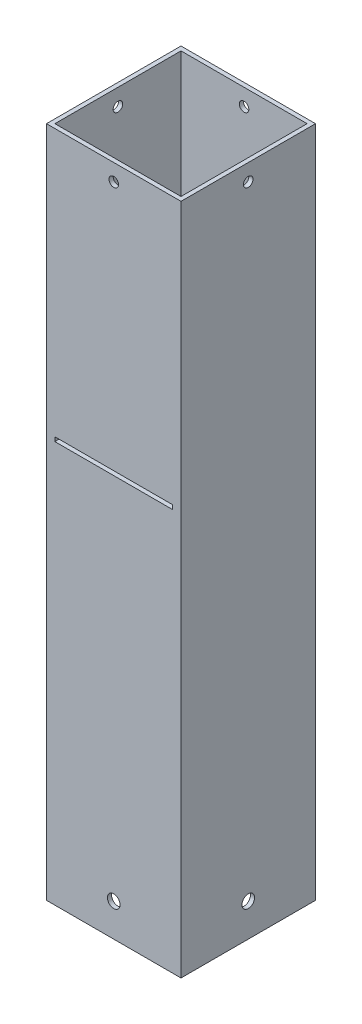
ISO-10303-21;
HEADER;
FILE_DESCRIPTION(('STEP AP214'),'2;1');
FILE_NAME('part.step','',(''),(''),'','','');
FILE_SCHEMA(('AUTOMOTIVE_DESIGN { 1 0 10303 214 1 1 1 1 }'));
ENDSEC;
DATA;
#1=APPLICATION_CONTEXT('core data for automotive mechanical design processes');
#2=APPLICATION_PROTOCOL_DEFINITION('international standard','automotive_design',2000,#1);
#3=PRODUCT_CONTEXT('',#1,'mechanical');
#4=PRODUCT('Part','Part','',(#3));
#5=PRODUCT_RELATED_PRODUCT_CATEGORY('part','',(#4));
#6=PRODUCT_DEFINITION_FORMATION('','',#4);
#7=PRODUCT_DEFINITION_CONTEXT('part definition',#1,'design');
#8=PRODUCT_DEFINITION('design','',#6,#7);
#9=PRODUCT_DEFINITION_SHAPE('','',#8);
#10=(LENGTH_UNIT() NAMED_UNIT(*) SI_UNIT(.MILLI.,.METRE.));
#11=(NAMED_UNIT(*) PLANE_ANGLE_UNIT() SI_UNIT($,.RADIAN.));
#12=(NAMED_UNIT(*) SI_UNIT($,.STERADIAN.) SOLID_ANGLE_UNIT());
#13=UNCERTAINTY_MEASURE_WITH_UNIT(LENGTH_MEASURE(1.E-05),#10,'distance_accuracy_value','');
#14=(GEOMETRIC_REPRESENTATION_CONTEXT(3) GLOBAL_UNCERTAINTY_ASSIGNED_CONTEXT((#13)) GLOBAL_UNIT_ASSIGNED_CONTEXT((#10,
#11,#12)) REPRESENTATION_CONTEXT('',''));
#15=CARTESIAN_POINT('',(0.,0.,0.));
#16=DIRECTION('',(0.,0.,1.));
#17=DIRECTION('',(1.,0.,0.));
#18=AXIS2_PLACEMENT_3D('',#15,#16,#17);
#19=CARTESIAN_POINT('',(0.,254.,0.));
#20=DIRECTION('',(0.,1.,0.));
#21=DIRECTION('',(0.,0.,1.));
#22=AXIS2_PLACEMENT_3D('',#19,#20,#21);
#23=PLANE('',#22);
#24=DIRECTION('',(0.,0.,1.));
#25=VECTOR('',#24,1.);
#26=CARTESIAN_POINT('',(-25.4,254.,-25.4));
#27=LINE('',#26,#25);
#28=CARTESIAN_POINT('',(-25.4,254.,-25.4));
#29=VERTEX_POINT('',#28);
#30=CARTESIAN_POINT('',(-25.4,254.,25.4));
#31=VERTEX_POINT('',#30);
#32=EDGE_CURVE('E278',#29,#31,#27,.T.);
#33=ORIENTED_EDGE('',*,*,#32,.T.);
#34=DIRECTION('',(1.,0.,0.));
#35=VECTOR('',#34,1.);
#36=CARTESIAN_POINT('',(-25.4,254.,25.4));
#37=LINE('',#36,#35);
#38=CARTESIAN_POINT('',(25.4,254.,25.4));
#39=VERTEX_POINT('',#38);
#40=EDGE_CURVE('E281',#31,#39,#37,.T.);
#41=ORIENTED_EDGE('',*,*,#40,.T.);
#42=DIRECTION('',(0.,0.,-1.));
#43=VECTOR('',#42,1.);
#44=CARTESIAN_POINT('',(25.4,254.,-25.4));
#45=LINE('',#44,#43);
#46=CARTESIAN_POINT('',(25.4,254.,-25.4));
#47=VERTEX_POINT('',#46);
#48=EDGE_CURVE('E284',#39,#47,#45,.T.);
#49=ORIENTED_EDGE('',*,*,#48,.T.);
#50=DIRECTION('',(-1.,0.,0.));
#51=VECTOR('',#50,1.);
#52=CARTESIAN_POINT('',(-25.4,254.,-25.4));
#53=LINE('',#52,#51);
#54=EDGE_CURVE('E286',#47,#29,#53,.T.);
#55=ORIENTED_EDGE('',*,*,#54,.T.);
#56=EDGE_LOOP('',(#33,#41,#49,#55));
#57=FACE_BOUND('',#56,.T.);
#58=DIRECTION('',(1.,0.,0.));
#59=VECTOR('',#58,1.);
#60=CARTESIAN_POINT('',(-23.8125,254.,23.8125));
#61=LINE('',#60,#59);
#62=CARTESIAN_POINT('',(-23.8125,254.,23.8125));
#63=VERTEX_POINT('',#62);
#64=CARTESIAN_POINT('',(23.8125,254.,23.8125));
#65=VERTEX_POINT('',#64);
#66=EDGE_CURVE('E249',#63,#65,#61,.T.);
#67=ORIENTED_EDGE('',*,*,#66,.F.);
#68=DIRECTION('',(0.,0.,1.));
#69=VECTOR('',#68,1.);
#70=CARTESIAN_POINT('',(-23.8125,254.,-23.8125));
#71=LINE('',#70,#69);
#72=CARTESIAN_POINT('',(-23.8125,254.,-23.8125));
#73=VERTEX_POINT('',#72);
#74=EDGE_CURVE('E247',#73,#63,#71,.T.);
#75=ORIENTED_EDGE('',*,*,#74,.F.);
#76=DIRECTION('',(-1.,0.,0.));
#77=VECTOR('',#76,1.);
#78=CARTESIAN_POINT('',(-23.8125,254.,-23.8125));
#79=LINE('',#78,#77);
#80=CARTESIAN_POINT('',(23.8125,254.,-23.8125));
#81=VERTEX_POINT('',#80);
#82=EDGE_CURVE('E255',#81,#73,#79,.T.);
#83=ORIENTED_EDGE('',*,*,#82,.F.);
#84=DIRECTION('',(0.,0.,-1.));
#85=VECTOR('',#84,1.);
#86=CARTESIAN_POINT('',(23.8125,254.,-23.8125));
#87=LINE('',#86,#85);
#88=EDGE_CURVE('E252',#65,#81,#87,.T.);
#89=ORIENTED_EDGE('',*,*,#88,.F.);
#90=EDGE_LOOP('',(#67,#75,#83,#89));
#91=FACE_BOUND('',#90,.T.);
#92=ADVANCED_FACE('F38',(#57,#91),#23,.T.);
#93=CARTESIAN_POINT('',(0.,0.,0.));
#94=DIRECTION('',(0.,1.,0.));
#95=DIRECTION('',(0.,0.,1.));
#96=AXIS2_PLACEMENT_3D('',#93,#94,#95);
#97=PLANE('',#96);
#98=DIRECTION('',(0.,0.,1.));
#99=VECTOR('',#98,1.);
#100=CARTESIAN_POINT('',(-25.4,0.,-25.4));
#101=LINE('',#100,#99);
#102=CARTESIAN_POINT('',(-25.4,0.,-25.4));
#103=VERTEX_POINT('',#102);
#104=CARTESIAN_POINT('',(-25.4,0.,25.4));
#105=VERTEX_POINT('',#104);
#106=EDGE_CURVE('E277',#103,#105,#101,.T.);
#107=ORIENTED_EDGE('',*,*,#106,.F.);
#108=DIRECTION('',(-1.,0.,0.));
#109=VECTOR('',#108,1.);
#110=CARTESIAN_POINT('',(-25.4,0.,-25.4));
#111=LINE('',#110,#109);
#112=CARTESIAN_POINT('',(25.4,0.,-25.4));
#113=VERTEX_POINT('',#112);
#114=EDGE_CURVE('E282',#113,#103,#111,.T.);
#115=ORIENTED_EDGE('',*,*,#114,.F.);
#116=DIRECTION('',(0.,0.,-1.));
#117=VECTOR('',#116,1.);
#118=CARTESIAN_POINT('',(25.4,0.,-25.4));
#119=LINE('',#118,#117);
#120=CARTESIAN_POINT('',(25.4,0.,25.4));
#121=VERTEX_POINT('',#120);
#122=EDGE_CURVE('E293',#121,#113,#119,.T.);
#123=ORIENTED_EDGE('',*,*,#122,.F.);
#124=DIRECTION('',(1.,0.,0.));
#125=VECTOR('',#124,1.);
#126=CARTESIAN_POINT('',(-25.4,0.,25.4));
#127=LINE('',#126,#125);
#128=EDGE_CURVE('E291',#105,#121,#127,.T.);
#129=ORIENTED_EDGE('',*,*,#128,.F.);
#130=EDGE_LOOP('',(#107,#115,#123,#129));
#131=FACE_BOUND('',#130,.T.);
#132=DIRECTION('',(0.,0.,1.));
#133=VECTOR('',#132,1.);
#134=CARTESIAN_POINT('',(-23.8125,0.,-23.8125));
#135=LINE('',#134,#133);
#136=CARTESIAN_POINT('',(-23.8125,0.,-23.8125));
#137=VERTEX_POINT('',#136);
#138=CARTESIAN_POINT('',(-23.8125,0.,23.8125));
#139=VERTEX_POINT('',#138);
#140=EDGE_CURVE('E246',#137,#139,#135,.T.);
#141=ORIENTED_EDGE('',*,*,#140,.T.);
#142=DIRECTION('',(1.,0.,0.));
#143=VECTOR('',#142,1.);
#144=CARTESIAN_POINT('',(-23.8125,0.,23.8125));
#145=LINE('',#144,#143);
#146=CARTESIAN_POINT('',(23.8125,0.,23.8125));
#147=VERTEX_POINT('',#146);
#148=EDGE_CURVE('E260',#139,#147,#145,.T.);
#149=ORIENTED_EDGE('',*,*,#148,.T.);
#150=DIRECTION('',(0.,0.,-1.));
#151=VECTOR('',#150,1.);
#152=CARTESIAN_POINT('',(23.8125,0.,-23.8125));
#153=LINE('',#152,#151);
#154=CARTESIAN_POINT('',(23.8125,0.,-23.8125));
#155=VERTEX_POINT('',#154);
#156=EDGE_CURVE('E263',#147,#155,#153,.T.);
#157=ORIENTED_EDGE('',*,*,#156,.T.);
#158=DIRECTION('',(-1.,0.,0.));
#159=VECTOR('',#158,1.);
#160=CARTESIAN_POINT('',(-23.8125,0.,-23.8125));
#161=LINE('',#160,#159);
#162=EDGE_CURVE('E250',#155,#137,#161,.T.);
#163=ORIENTED_EDGE('',*,*,#162,.T.);
#164=EDGE_LOOP('',(#141,#149,#157,#163));
#165=FACE_BOUND('',#164,.T.);
#166=ADVANCED_FACE('F341',(#131,#165),#97,.F.);
#167=CARTESIAN_POINT('',(-25.4,254.,-25.4));
#168=DIRECTION('',(1.,0.,0.));
#169=DIRECTION('',(0.,0.,-1.));
#170=AXIS2_PLACEMENT_3D('',#167,#168,#169);
#171=PLANE('',#170);
#172=CARTESIAN_POINT('',(-25.4,247.65,0.));
#173=DIRECTION('',(1.,0.,0.));
#174=DIRECTION('',(0.,0.,-1.));
#175=AXIS2_PLACEMENT_3D('',#172,#173,#174);
#176=CIRCLE('',#175,1.8034);
#177=CARTESIAN_POINT('',(-25.4,247.65,-1.80339999999998));
#178=VERTEX_POINT('',#177);
#179=EDGE_CURVE('E217',#178,#178,#176,.T.);
#180=ORIENTED_EDGE('',*,*,#179,.T.);
#181=EDGE_LOOP('',(#180));
#182=FACE_BOUND('',#181,.T.);
#183=CARTESIAN_POINT('',(-25.4,12.412400118,0.));
#184=DIRECTION('',(1.,0.,0.));
#185=DIRECTION('',(0.,0.,-1.));
#186=AXIS2_PLACEMENT_3D('',#183,#184,#185);
#187=CIRCLE('',#186,2.3999952);
#188=CARTESIAN_POINT('',(-25.4,12.412400118,-2.39999519999999));
#189=VERTEX_POINT('',#188);
#190=EDGE_CURVE('E236',#189,#189,#187,.T.);
#191=ORIENTED_EDGE('',*,*,#190,.T.);
#192=EDGE_LOOP('',(#191));
#193=FACE_BOUND('',#192,.T.);
#194=ORIENTED_EDGE('',*,*,#106,.T.);
#195=DIRECTION('',(0.,-1.,0.));
#196=VECTOR('',#195,1.);
#197=CARTESIAN_POINT('',(-25.4,254.,25.4));
#198=LINE('',#197,#196);
#199=EDGE_CURVE('E304',#31,#105,#198,.T.);
#200=ORIENTED_EDGE('',*,*,#199,.F.);
#201=ORIENTED_EDGE('',*,*,#32,.F.);
#202=DIRECTION('',(0.,-1.,0.));
#203=VECTOR('',#202,1.);
#204=CARTESIAN_POINT('',(-25.4,254.,-25.4));
#205=LINE('',#204,#203);
#206=EDGE_CURVE('E288',#29,#103,#205,.T.);
#207=ORIENTED_EDGE('',*,*,#206,.T.);
#208=EDGE_LOOP('',(#194,#200,#201,#207));
#209=FACE_BOUND('',#208,.T.);
#210=ADVANCED_FACE('F40',(#182,#193,#209),#171,.F.);
#211=CARTESIAN_POINT('',(-25.4,254.,25.4));
#212=DIRECTION('',(0.,0.,-1.));
#213=DIRECTION('',(-1.,0.,0.));
#214=AXIS2_PLACEMENT_3D('',#211,#212,#213);
#215=PLANE('',#214);
#216=DIRECTION('',(1.,0.,0.));
#217=VECTOR('',#216,1.);
#218=CARTESIAN_POINT('',(-22.225,151.60625,25.4));
#219=LINE('',#218,#217);
#220=CARTESIAN_POINT('',(-22.225,151.60625,25.4));
#221=VERTEX_POINT('',#220);
#222=CARTESIAN_POINT('',(22.225,151.60625,25.4));
#223=VERTEX_POINT('',#222);
#224=EDGE_CURVE('E184',#221,#223,#219,.T.);
#225=ORIENTED_EDGE('',*,*,#224,.F.);
#226=DIRECTION('',(0.,-1.,0.));
#227=VECTOR('',#226,1.);
#228=CARTESIAN_POINT('',(-22.225,153.19375,25.4));
#229=LINE('',#228,#227);
#230=CARTESIAN_POINT('',(-22.225,153.19375,25.4));
#231=VERTEX_POINT('',#230);
#232=EDGE_CURVE('E53',#231,#221,#229,.T.);
#233=ORIENTED_EDGE('',*,*,#232,.F.);
#234=DIRECTION('',(-1.,0.,0.));
#235=VECTOR('',#234,1.);
#236=CARTESIAN_POINT('',(-22.225,153.19375,25.4));
#237=LINE('',#236,#235);
#238=CARTESIAN_POINT('',(22.225,153.19375,25.4));
#239=VERTEX_POINT('',#238);
#240=EDGE_CURVE('E175',#239,#231,#237,.T.);
#241=ORIENTED_EDGE('',*,*,#240,.F.);
#242=DIRECTION('',(0.,1.,0.));
#243=VECTOR('',#242,1.);
#244=CARTESIAN_POINT('',(22.225,153.19375,25.4));
#245=LINE('',#244,#243);
#246=EDGE_CURVE('E178',#223,#239,#245,.T.);
#247=ORIENTED_EDGE('',*,*,#246,.F.);
#248=EDGE_LOOP('',(#225,#233,#241,#247));
#249=FACE_BOUND('',#248,.T.);
#250=CARTESIAN_POINT('',(0.,247.65,25.4));
#251=DIRECTION('',(0.,0.,1.));
#252=DIRECTION('',(1.,0.,0.));
#253=AXIS2_PLACEMENT_3D('',#250,#251,#252);
#254=CIRCLE('',#253,1.8034);
#255=CARTESIAN_POINT('',(1.8034,247.65,25.4));
#256=VERTEX_POINT('',#255);
#257=EDGE_CURVE('E206',#256,#256,#254,.T.);
#258=ORIENTED_EDGE('',*,*,#257,.F.);
#259=EDGE_LOOP('',(#258));
#260=FACE_BOUND('',#259,.T.);
#261=CARTESIAN_POINT('',(0.,12.412400118,25.4));
#262=DIRECTION('',(0.,0.,-1.));
#263=DIRECTION('',(-1.,0.,0.));
#264=AXIS2_PLACEMENT_3D('',#261,#262,#263);
#265=CIRCLE('',#264,2.3999952);
#266=CARTESIAN_POINT('',(-2.39999520000001,12.412400118,25.4));
#267=VERTEX_POINT('',#266);
#268=EDGE_CURVE('E227',#267,#267,#265,.T.);
#269=ORIENTED_EDGE('',*,*,#268,.T.);
#270=EDGE_LOOP('',(#269));
#271=FACE_BOUND('',#270,.T.);
#272=ORIENTED_EDGE('',*,*,#128,.T.);
#273=DIRECTION('',(0.,-1.,0.));
#274=VECTOR('',#273,1.);
#275=CARTESIAN_POINT('',(25.4,254.,25.4));
#276=LINE('',#275,#274);
#277=EDGE_CURVE('E301',#39,#121,#276,.T.);
#278=ORIENTED_EDGE('',*,*,#277,.F.);
#279=ORIENTED_EDGE('',*,*,#40,.F.);
#280=ORIENTED_EDGE('',*,*,#199,.T.);
#281=EDGE_LOOP('',(#272,#278,#279,#280));
#282=FACE_BOUND('',#281,.T.);
#283=ADVANCED_FACE('F358',(#249,#260,#271,#282),#215,.F.);
#284=CARTESIAN_POINT('',(25.4,254.,-25.4));
#285=DIRECTION('',(-1.,0.,0.));
#286=DIRECTION('',(0.,0.,1.));
#287=AXIS2_PLACEMENT_3D('',#284,#285,#286);
#288=PLANE('',#287);
#289=CARTESIAN_POINT('',(25.4,247.65,0.));
#290=DIRECTION('',(1.,0.,0.));
#291=DIRECTION('',(0.,0.,-1.));
#292=AXIS2_PLACEMENT_3D('',#289,#290,#291);
#293=CIRCLE('',#292,1.8034);
#294=CARTESIAN_POINT('',(25.4,247.65,-1.8034));
#295=VERTEX_POINT('',#294);
#296=EDGE_CURVE('E216',#295,#295,#293,.T.);
#297=ORIENTED_EDGE('',*,*,#296,.F.);
#298=EDGE_LOOP('',(#297));
#299=FACE_BOUND('',#298,.T.);
#300=CARTESIAN_POINT('',(25.4,12.412400118,0.));
#301=DIRECTION('',(-1.,0.,0.));
#302=DIRECTION('',(0.,0.,1.));
#303=AXIS2_PLACEMENT_3D('',#300,#301,#302);
#304=CIRCLE('',#303,2.3999952);
#305=CARTESIAN_POINT('',(25.4,12.412400118,2.3999952));
#306=VERTEX_POINT('',#305);
#307=EDGE_CURVE('E243',#306,#306,#304,.T.);
#308=ORIENTED_EDGE('',*,*,#307,.T.);
#309=EDGE_LOOP('',(#308));
#310=FACE_BOUND('',#309,.T.);
#311=ORIENTED_EDGE('',*,*,#122,.T.);
#312=DIRECTION('',(0.,-1.,0.));
#313=VECTOR('',#312,1.);
#314=CARTESIAN_POINT('',(25.4,254.,-25.4));
#315=LINE('',#314,#313);
#316=EDGE_CURVE('E298',#47,#113,#315,.T.);
#317=ORIENTED_EDGE('',*,*,#316,.F.);
#318=ORIENTED_EDGE('',*,*,#48,.F.);
#319=ORIENTED_EDGE('',*,*,#277,.T.);
#320=EDGE_LOOP('',(#311,#317,#318,#319));
#321=FACE_BOUND('',#320,.T.);
#322=ADVANCED_FACE('F356',(#299,#310,#321),#288,.F.);
#323=CARTESIAN_POINT('',(-25.4,254.,-25.4));
#324=DIRECTION('',(0.,0.,1.));
#325=DIRECTION('',(1.,0.,0.));
#326=AXIS2_PLACEMENT_3D('',#323,#324,#325);
#327=PLANE('',#326);
#328=DIRECTION('',(-1.,0.,0.));
#329=VECTOR('',#328,1.);
#330=CARTESIAN_POINT('',(-22.225,153.19375,-25.4));
#331=LINE('',#330,#329);
#332=CARTESIAN_POINT('',(22.225,153.19375,-25.4));
#333=VERTEX_POINT('',#332);
#334=CARTESIAN_POINT('',(-22.225,153.19375,-25.4));
#335=VERTEX_POINT('',#334);
#336=EDGE_CURVE('E174',#333,#335,#331,.T.);
#337=ORIENTED_EDGE('',*,*,#336,.T.);
#338=DIRECTION('',(0.,-1.,0.));
#339=VECTOR('',#338,1.);
#340=CARTESIAN_POINT('',(-22.225,153.19375,-25.4));
#341=LINE('',#340,#339);
#342=CARTESIAN_POINT('',(-22.225,151.60625,-25.4));
#343=VERTEX_POINT('',#342);
#344=EDGE_CURVE('E157',#335,#343,#341,.T.);
#345=ORIENTED_EDGE('',*,*,#344,.T.);
#346=DIRECTION('',(1.,0.,0.));
#347=VECTOR('',#346,1.);
#348=CARTESIAN_POINT('',(-22.225,151.60625,-25.4));
#349=LINE('',#348,#347);
#350=CARTESIAN_POINT('',(22.225,151.60625,-25.4));
#351=VERTEX_POINT('',#350);
#352=EDGE_CURVE('E166',#343,#351,#349,.T.);
#353=ORIENTED_EDGE('',*,*,#352,.T.);
#354=DIRECTION('',(0.,1.,0.));
#355=VECTOR('',#354,1.);
#356=CARTESIAN_POINT('',(22.225,153.19375,-25.4));
#357=LINE('',#356,#355);
#358=EDGE_CURVE('E61',#351,#333,#357,.T.);
#359=ORIENTED_EDGE('',*,*,#358,.T.);
#360=EDGE_LOOP('',(#337,#345,#353,#359));
#361=FACE_BOUND('',#360,.T.);
#362=CARTESIAN_POINT('',(0.,247.65,-25.4));
#363=DIRECTION('',(0.,0.,1.));
#364=DIRECTION('',(1.,0.,0.));
#365=AXIS2_PLACEMENT_3D('',#362,#363,#364);
#366=CIRCLE('',#365,1.8034);
#367=CARTESIAN_POINT('',(1.8034,247.65,-25.4));
#368=VERTEX_POINT('',#367);
#369=EDGE_CURVE('E207',#368,#368,#366,.T.);
#370=ORIENTED_EDGE('',*,*,#369,.T.);
#371=EDGE_LOOP('',(#370));
#372=FACE_BOUND('',#371,.T.);
#373=CARTESIAN_POINT('',(0.,12.412400118,-25.4));
#374=DIRECTION('',(0.,0.,-1.));
#375=DIRECTION('',(-1.,0.,0.));
#376=AXIS2_PLACEMENT_3D('',#373,#374,#375);
#377=CIRCLE('',#376,2.3999952);
#378=CARTESIAN_POINT('',(-2.39999520000001,12.412400118,-25.4));
#379=VERTEX_POINT('',#378);
#380=EDGE_CURVE('E226',#379,#379,#377,.T.);
#381=ORIENTED_EDGE('',*,*,#380,.F.);
#382=EDGE_LOOP('',(#381));
#383=FACE_BOUND('',#382,.T.);
#384=ORIENTED_EDGE('',*,*,#114,.T.);
#385=ORIENTED_EDGE('',*,*,#206,.F.);
#386=ORIENTED_EDGE('',*,*,#54,.F.);
#387=ORIENTED_EDGE('',*,*,#316,.T.);
#388=EDGE_LOOP('',(#384,#385,#386,#387));
#389=FACE_BOUND('',#388,.T.);
#390=ADVANCED_FACE('F171',(#361,#372,#383,#389),#327,.F.);
#391=CARTESIAN_POINT('',(-23.8125,254.,-23.8125));
#392=DIRECTION('',(1.,0.,0.));
#393=DIRECTION('',(0.,0.,-1.));
#394=AXIS2_PLACEMENT_3D('',#391,#392,#393);
#395=PLANE('',#394);
#396=CARTESIAN_POINT('',(-23.8125,247.65,0.));
#397=DIRECTION('',(1.,0.,0.));
#398=DIRECTION('',(0.,0.,-1.));
#399=AXIS2_PLACEMENT_3D('',#396,#397,#398);
#400=CIRCLE('',#399,1.8034);
#401=CARTESIAN_POINT('',(-23.8125,247.65,-1.80339999999998));
#402=VERTEX_POINT('',#401);
#403=EDGE_CURVE('E223',#402,#402,#400,.T.);
#404=ORIENTED_EDGE('',*,*,#403,.F.);
#405=EDGE_LOOP('',(#404));
#406=FACE_BOUND('',#405,.T.);
#407=CARTESIAN_POINT('',(-23.8125,12.412400118,0.));
#408=DIRECTION('',(1.,0.,0.));
#409=DIRECTION('',(0.,0.,-1.));
#410=AXIS2_PLACEMENT_3D('',#407,#408,#409);
#411=CIRCLE('',#410,2.3999952);
#412=CARTESIAN_POINT('',(-23.8125,12.412400118,-2.39999519999999));
#413=VERTEX_POINT('',#412);
#414=EDGE_CURVE('E240',#413,#413,#411,.T.);
#415=ORIENTED_EDGE('',*,*,#414,.F.);
#416=EDGE_LOOP('',(#415));
#417=FACE_BOUND('',#416,.T.);
#418=ORIENTED_EDGE('',*,*,#140,.F.);
#419=DIRECTION('',(0.,-1.,0.));
#420=VECTOR('',#419,1.);
#421=CARTESIAN_POINT('',(-23.8125,254.,-23.8125));
#422=LINE('',#421,#420);
#423=EDGE_CURVE('E257',#73,#137,#422,.T.);
#424=ORIENTED_EDGE('',*,*,#423,.F.);
#425=ORIENTED_EDGE('',*,*,#74,.T.);
#426=DIRECTION('',(0.,-1.,0.));
#427=VECTOR('',#426,1.);
#428=CARTESIAN_POINT('',(-23.8125,254.,23.8125));
#429=LINE('',#428,#427);
#430=EDGE_CURVE('E274',#63,#139,#429,.T.);
#431=ORIENTED_EDGE('',*,*,#430,.T.);
#432=EDGE_LOOP('',(#418,#424,#425,#431));
#433=FACE_BOUND('',#432,.T.);
#434=ADVANCED_FACE('F351',(#406,#417,#433),#395,.T.);
#435=CARTESIAN_POINT('',(-23.8125,254.,23.8125));
#436=DIRECTION('',(0.,0.,-1.));
#437=DIRECTION('',(-1.,0.,0.));
#438=AXIS2_PLACEMENT_3D('',#435,#436,#437);
#439=PLANE('',#438);
#440=DIRECTION('',(0.,1.,0.));
#441=VECTOR('',#440,1.);
#442=CARTESIAN_POINT('',(-22.225,254.,23.8125));
#443=LINE('',#442,#441);
#444=CARTESIAN_POINT('',(-22.225,151.60625,23.8125));
#445=VERTEX_POINT('',#444);
#446=CARTESIAN_POINT('',(-22.225,153.19375,23.8125));
#447=VERTEX_POINT('',#446);
#448=EDGE_CURVE('E204',#445,#447,#443,.T.);
#449=ORIENTED_EDGE('',*,*,#448,.F.);
#450=DIRECTION('',(-1.,0.,0.));
#451=VECTOR('',#450,1.);
#452=CARTESIAN_POINT('',(-23.8125,151.60625,23.8125));
#453=LINE('',#452,#451);
#454=CARTESIAN_POINT('',(22.225,151.60625,23.8125));
#455=VERTEX_POINT('',#454);
#456=EDGE_CURVE('E191',#455,#445,#453,.T.);
#457=ORIENTED_EDGE('',*,*,#456,.F.);
#458=DIRECTION('',(0.,-1.,0.));
#459=VECTOR('',#458,1.);
#460=CARTESIAN_POINT('',(22.2250000000005,254.,23.8125));
#461=LINE('',#460,#459);
#462=CARTESIAN_POINT('',(22.225,153.19375,23.8125));
#463=VERTEX_POINT('',#462);
#464=EDGE_CURVE('E199',#463,#455,#461,.T.);
#465=ORIENTED_EDGE('',*,*,#464,.F.);
#466=DIRECTION('',(1.,0.,0.));
#467=VECTOR('',#466,1.);
#468=CARTESIAN_POINT('',(-23.8125,153.19375,23.8125));
#469=LINE('',#468,#467);
#470=EDGE_CURVE('E202',#447,#463,#469,.T.);
#471=ORIENTED_EDGE('',*,*,#470,.F.);
#472=EDGE_LOOP('',(#449,#457,#465,#471));
#473=FACE_BOUND('',#472,.T.);
#474=CARTESIAN_POINT('',(0.,247.65,23.8125));
#475=DIRECTION('',(0.,0.,-1.));
#476=DIRECTION('',(-1.,0.,0.));
#477=AXIS2_PLACEMENT_3D('',#474,#475,#476);
#478=CIRCLE('',#477,1.8034);
#479=CARTESIAN_POINT('',(-1.8034,247.65,23.8125));
#480=VERTEX_POINT('',#479);
#481=EDGE_CURVE('E213',#480,#480,#478,.T.);
#482=ORIENTED_EDGE('',*,*,#481,.F.);
#483=EDGE_LOOP('',(#482));
#484=FACE_BOUND('',#483,.T.);
#485=CARTESIAN_POINT('',(0.,12.412400118,23.8125));
#486=DIRECTION('',(0.,0.,-1.));
#487=DIRECTION('',(-1.,0.,0.));
#488=AXIS2_PLACEMENT_3D('',#485,#486,#487);
#489=CIRCLE('',#488,2.3999952);
#490=CARTESIAN_POINT('',(-2.39999520000001,12.412400118,23.8125));
#491=VERTEX_POINT('',#490);
#492=EDGE_CURVE('E233',#491,#491,#489,.T.);
#493=ORIENTED_EDGE('',*,*,#492,.F.);
#494=EDGE_LOOP('',(#493));
#495=FACE_BOUND('',#494,.T.);
#496=ORIENTED_EDGE('',*,*,#148,.F.);
#497=ORIENTED_EDGE('',*,*,#430,.F.);
#498=ORIENTED_EDGE('',*,*,#66,.T.);
#499=DIRECTION('',(0.,-1.,0.));
#500=VECTOR('',#499,1.);
#501=CARTESIAN_POINT('',(23.8125,254.,23.8125));
#502=LINE('',#501,#500);
#503=EDGE_CURVE('E272',#65,#147,#502,.T.);
#504=ORIENTED_EDGE('',*,*,#503,.T.);
#505=EDGE_LOOP('',(#496,#497,#498,#504));
#506=FACE_BOUND('',#505,.T.);
#507=ADVANCED_FACE('F397',(#473,#484,#495,#506),#439,.T.);
#508=CARTESIAN_POINT('',(23.8125,254.,-23.8125));
#509=DIRECTION('',(-1.,0.,0.));
#510=DIRECTION('',(0.,0.,1.));
#511=AXIS2_PLACEMENT_3D('',#508,#509,#510);
#512=PLANE('',#511);
#513=CARTESIAN_POINT('',(23.8125,247.65,0.));
#514=DIRECTION('',(-1.,0.,0.));
#515=DIRECTION('',(0.,0.,1.));
#516=AXIS2_PLACEMENT_3D('',#513,#514,#515);
#517=CIRCLE('',#516,1.8034);
#518=CARTESIAN_POINT('',(23.8125,247.65,1.8034));
#519=VERTEX_POINT('',#518);
#520=EDGE_CURVE('E220',#519,#519,#517,.T.);
#521=ORIENTED_EDGE('',*,*,#520,.F.);
#522=EDGE_LOOP('',(#521));
#523=FACE_BOUND('',#522,.T.);
#524=CARTESIAN_POINT('',(23.8125,12.412400118,0.));
#525=DIRECTION('',(-1.,0.,0.));
#526=DIRECTION('',(0.,0.,1.));
#527=AXIS2_PLACEMENT_3D('',#524,#525,#526);
#528=CIRCLE('',#527,2.3999952);
#529=CARTESIAN_POINT('',(23.8125,12.412400118,2.3999952));
#530=VERTEX_POINT('',#529);
#531=EDGE_CURVE('E239',#530,#530,#528,.T.);
#532=ORIENTED_EDGE('',*,*,#531,.F.);
#533=EDGE_LOOP('',(#532));
#534=FACE_BOUND('',#533,.T.);
#535=ORIENTED_EDGE('',*,*,#156,.F.);
#536=ORIENTED_EDGE('',*,*,#503,.F.);
#537=ORIENTED_EDGE('',*,*,#88,.T.);
#538=DIRECTION('',(0.,-1.,0.));
#539=VECTOR('',#538,1.);
#540=CARTESIAN_POINT('',(23.8125,254.,-23.8125));
#541=LINE('',#540,#539);
#542=EDGE_CURVE('E270',#81,#155,#541,.T.);
#543=ORIENTED_EDGE('',*,*,#542,.T.);
#544=EDGE_LOOP('',(#535,#536,#537,#543));
#545=FACE_BOUND('',#544,.T.);
#546=ADVANCED_FACE('F401',(#523,#534,#545),#512,.T.);
#547=CARTESIAN_POINT('',(-23.8125,254.,-23.8125));
#548=DIRECTION('',(0.,0.,1.));
#549=DIRECTION('',(1.,0.,0.));
#550=AXIS2_PLACEMENT_3D('',#547,#548,#549);
#551=PLANE('',#550);
#552=DIRECTION('',(0.,-1.,0.));
#553=VECTOR('',#552,1.);
#554=CARTESIAN_POINT('',(-22.225,254.,-23.8125));
#555=LINE('',#554,#553);
#556=CARTESIAN_POINT('',(-22.225,153.19375,-23.8125));
#557=VERTEX_POINT('',#556);
#558=CARTESIAN_POINT('',(-22.225,151.60625,-23.8125));
#559=VERTEX_POINT('',#558);
#560=EDGE_CURVE('E11',#557,#559,#555,.T.);
#561=ORIENTED_EDGE('',*,*,#560,.F.);
#562=DIRECTION('',(-1.,0.,0.));
#563=VECTOR('',#562,1.);
#564=CARTESIAN_POINT('',(-23.8125,153.19375,-23.8125));
#565=LINE('',#564,#563);
#566=CARTESIAN_POINT('',(22.225,153.19375,-23.8125));
#567=VERTEX_POINT('',#566);
#568=EDGE_CURVE('E46',#567,#557,#565,.T.);
#569=ORIENTED_EDGE('',*,*,#568,.F.);
#570=DIRECTION('',(0.,1.,0.));
#571=VECTOR('',#570,1.);
#572=CARTESIAN_POINT('',(22.2250000000005,254.,-23.8125));
#573=LINE('',#572,#571);
#574=CARTESIAN_POINT('',(22.225,151.60625,-23.8125));
#575=VERTEX_POINT('',#574);
#576=EDGE_CURVE('E317',#575,#567,#573,.T.);
#577=ORIENTED_EDGE('',*,*,#576,.F.);
#578=DIRECTION('',(1.,0.,0.));
#579=VECTOR('',#578,1.);
#580=CARTESIAN_POINT('',(-23.8125,151.60625,-23.8125));
#581=LINE('',#580,#579);
#582=EDGE_CURVE('E307',#559,#575,#581,.T.);
#583=ORIENTED_EDGE('',*,*,#582,.F.);
#584=EDGE_LOOP('',(#561,#569,#577,#583));
#585=FACE_BOUND('',#584,.T.);
#586=CARTESIAN_POINT('',(0.,247.65,-23.8125));
#587=DIRECTION('',(0.,0.,1.));
#588=DIRECTION('',(1.,0.,0.));
#589=AXIS2_PLACEMENT_3D('',#586,#587,#588);
#590=CIRCLE('',#589,1.8034);
#591=CARTESIAN_POINT('',(1.8034,247.65,-23.8125));
#592=VERTEX_POINT('',#591);
#593=EDGE_CURVE('E210',#592,#592,#590,.T.);
#594=ORIENTED_EDGE('',*,*,#593,.F.);
#595=EDGE_LOOP('',(#594));
#596=FACE_BOUND('',#595,.T.);
#597=CARTESIAN_POINT('',(0.,12.412400118,-23.8125));
#598=DIRECTION('',(0.,0.,1.));
#599=DIRECTION('',(1.,0.,0.));
#600=AXIS2_PLACEMENT_3D('',#597,#598,#599);
#601=CIRCLE('',#600,2.3999952);
#602=CARTESIAN_POINT('',(2.39999519999999,12.412400118,-23.8125));
#603=VERTEX_POINT('',#602);
#604=EDGE_CURVE('E230',#603,#603,#601,.T.);
#605=ORIENTED_EDGE('',*,*,#604,.F.);
#606=EDGE_LOOP('',(#605));
#607=FACE_BOUND('',#606,.T.);
#608=ORIENTED_EDGE('',*,*,#162,.F.);
#609=ORIENTED_EDGE('',*,*,#542,.F.);
#610=ORIENTED_EDGE('',*,*,#82,.T.);
#611=ORIENTED_EDGE('',*,*,#423,.T.);
#612=EDGE_LOOP('',(#608,#609,#610,#611));
#613=FACE_BOUND('',#612,.T.);
#614=ADVANCED_FACE('F323',(#585,#596,#607,#613),#551,.T.);
#615=CARTESIAN_POINT('',(-25.4,12.412400118,0.));
#616=DIRECTION('',(1.,0.,0.));
#617=DIRECTION('',(0.,0.,-1.));
#618=AXIS2_PLACEMENT_3D('',#615,#616,#617);
#619=CYLINDRICAL_SURFACE('',#618,2.3999952);
#620=ORIENTED_EDGE('',*,*,#531,.T.);
#621=EDGE_LOOP('',(#620));
#622=FACE_BOUND('',#621,.T.);
#623=ORIENTED_EDGE('',*,*,#307,.F.);
#624=EDGE_LOOP('',(#623));
#625=FACE_BOUND('',#624,.T.);
#626=ADVANCED_FACE('F409',(#622,#625),#619,.F.);
#627=ORIENTED_EDGE('',*,*,#414,.T.);
#628=EDGE_LOOP('',(#627));
#629=FACE_BOUND('',#628,.T.);
#630=ORIENTED_EDGE('',*,*,#190,.F.);
#631=EDGE_LOOP('',(#630));
#632=FACE_BOUND('',#631,.T.);
#633=ADVANCED_FACE('F417',(#629,#632),#619,.F.);
#634=CARTESIAN_POINT('',(0.,12.412400118,25.4));
#635=DIRECTION('',(0.,0.,-1.));
#636=DIRECTION('',(-1.,0.,0.));
#637=AXIS2_PLACEMENT_3D('',#634,#635,#636);
#638=CYLINDRICAL_SURFACE('',#637,2.3999952);
#639=ORIENTED_EDGE('',*,*,#604,.T.);
#640=EDGE_LOOP('',(#639));
#641=FACE_BOUND('',#640,.T.);
#642=ORIENTED_EDGE('',*,*,#380,.T.);
#643=EDGE_LOOP('',(#642));
#644=FACE_BOUND('',#643,.T.);
#645=ADVANCED_FACE('F419',(#641,#644),#638,.F.);
#646=ORIENTED_EDGE('',*,*,#492,.T.);
#647=EDGE_LOOP('',(#646));
#648=FACE_BOUND('',#647,.T.);
#649=ORIENTED_EDGE('',*,*,#268,.F.);
#650=EDGE_LOOP('',(#649));
#651=FACE_BOUND('',#650,.T.);
#652=ADVANCED_FACE('F422',(#648,#651),#638,.F.);
#653=CARTESIAN_POINT('',(-25.4,247.65,0.));
#654=DIRECTION('',(1.,0.,0.));
#655=DIRECTION('',(0.,0.,-1.));
#656=AXIS2_PLACEMENT_3D('',#653,#654,#655);
#657=CYLINDRICAL_SURFACE('',#656,1.8034);
#658=ORIENTED_EDGE('',*,*,#520,.T.);
#659=EDGE_LOOP('',(#658));
#660=FACE_BOUND('',#659,.T.);
#661=ORIENTED_EDGE('',*,*,#296,.T.);
#662=EDGE_LOOP('',(#661));
#663=FACE_BOUND('',#662,.T.);
#664=ADVANCED_FACE('F424',(#660,#663),#657,.F.);
#665=ORIENTED_EDGE('',*,*,#403,.T.);
#666=EDGE_LOOP('',(#665));
#667=FACE_BOUND('',#666,.T.);
#668=ORIENTED_EDGE('',*,*,#179,.F.);
#669=EDGE_LOOP('',(#668));
#670=FACE_BOUND('',#669,.T.);
#671=ADVANCED_FACE('F427',(#667,#670),#657,.F.);
#672=CARTESIAN_POINT('',(0.,247.65,-25.4));
#673=DIRECTION('',(0.,0.,1.));
#674=DIRECTION('',(1.,0.,0.));
#675=AXIS2_PLACEMENT_3D('',#672,#673,#674);
#676=CYLINDRICAL_SURFACE('',#675,1.8034);
#677=ORIENTED_EDGE('',*,*,#593,.T.);
#678=EDGE_LOOP('',(#677));
#679=FACE_BOUND('',#678,.T.);
#680=ORIENTED_EDGE('',*,*,#369,.F.);
#681=EDGE_LOOP('',(#680));
#682=FACE_BOUND('',#681,.T.);
#683=ADVANCED_FACE('F429',(#679,#682),#676,.F.);
#684=ORIENTED_EDGE('',*,*,#481,.T.);
#685=EDGE_LOOP('',(#684));
#686=FACE_BOUND('',#685,.T.);
#687=ORIENTED_EDGE('',*,*,#257,.T.);
#688=EDGE_LOOP('',(#687));
#689=FACE_BOUND('',#688,.T.);
#690=ADVANCED_FACE('F335',(#686,#689),#676,.F.);
#691=CARTESIAN_POINT('',(-22.225,151.60625,-25.4));
#692=DIRECTION('',(0.,-1.,0.));
#693=DIRECTION('',(0.,0.,-1.));
#694=AXIS2_PLACEMENT_3D('',#691,#692,#693);
#695=PLANE('',#694);
#696=ORIENTED_EDGE('',*,*,#582,.T.);
#697=DIRECTION('',(0.,0.,1.));
#698=VECTOR('',#697,1.);
#699=CARTESIAN_POINT('',(22.225,151.60625,-25.4));
#700=LINE('',#699,#698);
#701=EDGE_CURVE('E168',#351,#575,#700,.T.);
#702=ORIENTED_EDGE('',*,*,#701,.F.);
#703=ORIENTED_EDGE('',*,*,#352,.F.);
#704=DIRECTION('',(0.,0.,1.));
#705=VECTOR('',#704,1.);
#706=CARTESIAN_POINT('',(-22.225,151.60625,-25.4));
#707=LINE('',#706,#705);
#708=EDGE_CURVE('E152',#343,#559,#707,.T.);
#709=ORIENTED_EDGE('',*,*,#708,.T.);
#710=EDGE_LOOP('',(#696,#702,#703,#709));
#711=FACE_BOUND('',#710,.T.);
#712=ADVANCED_FACE('F167',(#711),#695,.F.);
#713=CARTESIAN_POINT('',(22.225,153.19375,-25.4));
#714=DIRECTION('',(1.,0.,0.));
#715=DIRECTION('',(0.,1.,0.));
#716=AXIS2_PLACEMENT_3D('',#713,#714,#715);
#717=PLANE('',#716);
#718=ORIENTED_EDGE('',*,*,#576,.T.);
#719=DIRECTION('',(0.,0.,1.));
#720=VECTOR('',#719,1.);
#721=CARTESIAN_POINT('',(22.225,153.19375,-25.4));
#722=LINE('',#721,#720);
#723=EDGE_CURVE('E193',#333,#567,#722,.T.);
#724=ORIENTED_EDGE('',*,*,#723,.F.);
#725=ORIENTED_EDGE('',*,*,#358,.F.);
#726=ORIENTED_EDGE('',*,*,#701,.T.);
#727=EDGE_LOOP('',(#718,#724,#725,#726));
#728=FACE_BOUND('',#727,.T.);
#729=ADVANCED_FACE('F325',(#728),#717,.F.);
#730=CARTESIAN_POINT('',(-22.225,153.19375,-25.4));
#731=DIRECTION('',(0.,1.,0.));
#732=DIRECTION('',(0.,0.,1.));
#733=AXIS2_PLACEMENT_3D('',#730,#731,#732);
#734=PLANE('',#733);
#735=ORIENTED_EDGE('',*,*,#568,.T.);
#736=DIRECTION('',(0.,0.,1.));
#737=VECTOR('',#736,1.);
#738=CARTESIAN_POINT('',(-22.225,153.19375,-25.4));
#739=LINE('',#738,#737);
#740=EDGE_CURVE('E189',#335,#557,#739,.T.);
#741=ORIENTED_EDGE('',*,*,#740,.F.);
#742=ORIENTED_EDGE('',*,*,#336,.F.);
#743=ORIENTED_EDGE('',*,*,#723,.T.);
#744=EDGE_LOOP('',(#735,#741,#742,#743));
#745=FACE_BOUND('',#744,.T.);
#746=ADVANCED_FACE('F320',(#745),#734,.F.);
#747=CARTESIAN_POINT('',(-22.225,153.19375,-25.4));
#748=DIRECTION('',(-1.,0.,0.));
#749=DIRECTION('',(0.,0.,1.));
#750=AXIS2_PLACEMENT_3D('',#747,#748,#749);
#751=PLANE('',#750);
#752=ORIENTED_EDGE('',*,*,#560,.T.);
#753=ORIENTED_EDGE('',*,*,#708,.F.);
#754=ORIENTED_EDGE('',*,*,#344,.F.);
#755=ORIENTED_EDGE('',*,*,#740,.T.);
#756=EDGE_LOOP('',(#752,#753,#754,#755));
#757=FACE_BOUND('',#756,.T.);
#758=ADVANCED_FACE('F154',(#757),#751,.F.);
#759=ORIENTED_EDGE('',*,*,#448,.T.);
#760=EDGE_CURVE('E192',#447,#231,#739,.T.);
#761=ORIENTED_EDGE('',*,*,#760,.T.);
#762=ORIENTED_EDGE('',*,*,#232,.T.);
#763=EDGE_CURVE('E163',#445,#221,#707,.T.);
#764=ORIENTED_EDGE('',*,*,#763,.F.);
#765=EDGE_LOOP('',(#759,#761,#762,#764));
#766=FACE_BOUND('',#765,.T.);
#767=ADVANCED_FACE('F434',(#766),#751,.F.);
#768=ORIENTED_EDGE('',*,*,#470,.T.);
#769=EDGE_CURVE('E196',#463,#239,#722,.T.);
#770=ORIENTED_EDGE('',*,*,#769,.T.);
#771=ORIENTED_EDGE('',*,*,#240,.T.);
#772=ORIENTED_EDGE('',*,*,#760,.F.);
#773=EDGE_LOOP('',(#768,#770,#771,#772));
#774=FACE_BOUND('',#773,.T.);
#775=ADVANCED_FACE('F334',(#774),#734,.F.);
#776=ORIENTED_EDGE('',*,*,#464,.T.);
#777=EDGE_CURVE('E162',#455,#223,#700,.T.);
#778=ORIENTED_EDGE('',*,*,#777,.T.);
#779=ORIENTED_EDGE('',*,*,#246,.T.);
#780=ORIENTED_EDGE('',*,*,#769,.F.);
#781=EDGE_LOOP('',(#776,#778,#779,#780));
#782=FACE_BOUND('',#781,.T.);
#783=ADVANCED_FACE('F328',(#782),#717,.F.);
#784=ORIENTED_EDGE('',*,*,#456,.T.);
#785=ORIENTED_EDGE('',*,*,#763,.T.);
#786=ORIENTED_EDGE('',*,*,#224,.T.);
#787=ORIENTED_EDGE('',*,*,#777,.F.);
#788=EDGE_LOOP('',(#784,#785,#786,#787));
#789=FACE_BOUND('',#788,.T.);
#790=ADVANCED_FACE('F337',(#789),#695,.F.);
#791=CLOSED_SHELL('',(#92,#166,#210,#283,#322,#390,#434,#507,#546,#614,#626,#633,#645,#652,#664,
#671,#683,#690,#712,#729,#746,#758,#767,#775,#783,#790));
#792=MANIFOLD_SOLID_BREP('B2',#791);
#793=ADVANCED_BREP_SHAPE_REPRESENTATION('',(#18,#792),#14);
#794=SHAPE_DEFINITION_REPRESENTATION(#9,#793);
ENDSEC;
END-ISO-10303-21;
